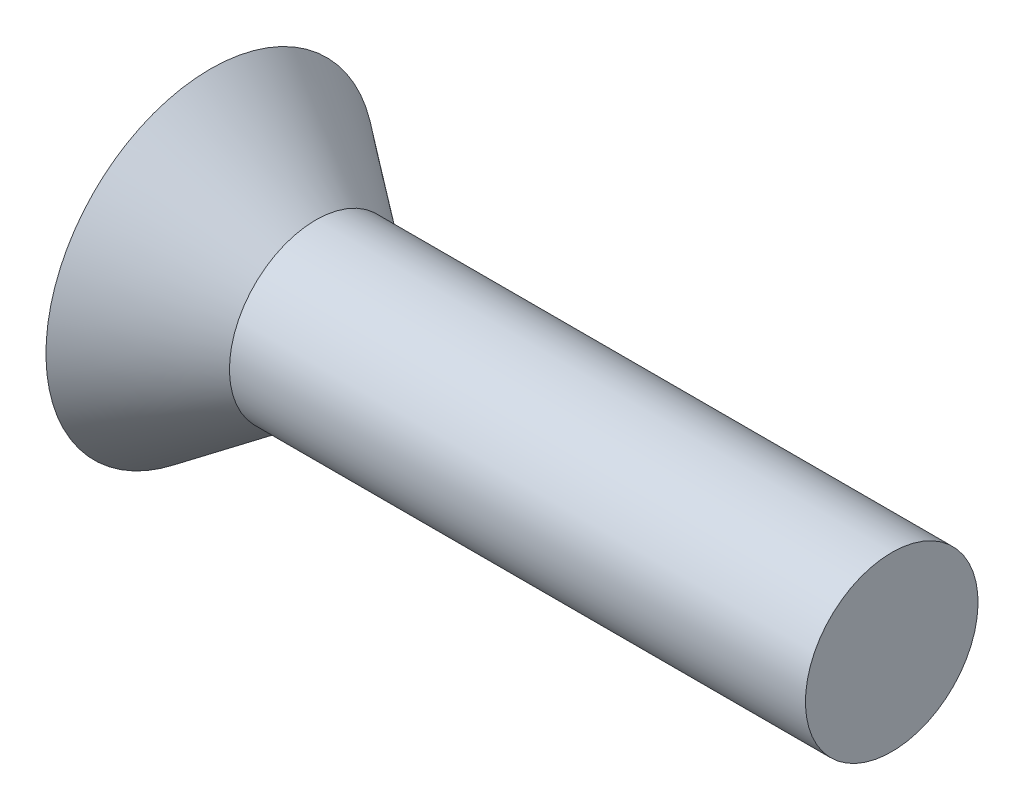
ISO-10303-21;
HEADER;
FILE_DESCRIPTION(('STEP AP214'),'2;1');
FILE_NAME('part.step','',(''),(''),'','','');
FILE_SCHEMA(('AUTOMOTIVE_DESIGN { 1 0 10303 214 1 1 1 1 }'));
ENDSEC;
DATA;
#1=APPLICATION_CONTEXT('core data for automotive mechanical design processes');
#2=APPLICATION_PROTOCOL_DEFINITION('international standard','automotive_design',2000,#1);
#3=PRODUCT_CONTEXT('',#1,'mechanical');
#4=PRODUCT('Part','Part','',(#3));
#5=PRODUCT_RELATED_PRODUCT_CATEGORY('part','',(#4));
#6=PRODUCT_DEFINITION_FORMATION('','',#4);
#7=PRODUCT_DEFINITION_CONTEXT('part definition',#1,'design');
#8=PRODUCT_DEFINITION('design','',#6,#7);
#9=PRODUCT_DEFINITION_SHAPE('','',#8);
#10=(LENGTH_UNIT() NAMED_UNIT(*) SI_UNIT(.MILLI.,.METRE.));
#11=(NAMED_UNIT(*) PLANE_ANGLE_UNIT() SI_UNIT($,.RADIAN.));
#12=(NAMED_UNIT(*) SI_UNIT($,.STERADIAN.) SOLID_ANGLE_UNIT());
#13=UNCERTAINTY_MEASURE_WITH_UNIT(LENGTH_MEASURE(1.E-05),#10,'distance_accuracy_value','');
#14=(GEOMETRIC_REPRESENTATION_CONTEXT(3) GLOBAL_UNCERTAINTY_ASSIGNED_CONTEXT((#13)) GLOBAL_UNIT_ASSIGNED_CONTEXT((#10,
#11,#12)) REPRESENTATION_CONTEXT('',''));
#15=CARTESIAN_POINT('',(0.,0.,0.));
#16=DIRECTION('',(0.,0.,1.));
#17=DIRECTION('',(1.,0.,0.));
#18=AXIS2_PLACEMENT_3D('',#15,#16,#17);
#19=CARTESIAN_POINT('',(-2.9464,2.413,0.));
#20=DIRECTION('',(-1.,0.,0.));
#21=DIRECTION('',(0.,-1.,0.));
#22=AXIS2_PLACEMENT_3D('',#19,#20,#21);
#23=CONICAL_SURFACE('',#22,4.5974,0.63796099926951);
#24=CARTESIAN_POINT('',(0.,2.413,0.));
#25=DIRECTION('',(1.,0.,0.));
#26=DIRECTION('',(0.,1.,0.));
#27=AXIS2_PLACEMENT_3D('',#24,#25,#26);
#28=CIRCLE('',#27,2.413);
#29=CARTESIAN_POINT('',(0.,4.82599999999999,0.));
#30=VERTEX_POINT('',#29);
#31=EDGE_CURVE('E10',#30,#30,#28,.T.);
#32=ORIENTED_EDGE('',*,*,#31,.F.);
#33=EDGE_LOOP('',(#32));
#34=FACE_BOUND('',#33,.T.);
#35=CARTESIAN_POINT('',(-2.9464,2.413,0.));
#36=DIRECTION('',(1.,0.,0.));
#37=DIRECTION('',(0.,1.,0.));
#38=AXIS2_PLACEMENT_3D('',#35,#36,#37);
#39=CIRCLE('',#38,4.5974);
#40=CARTESIAN_POINT('',(-2.9464,7.0104,0.));
#41=VERTEX_POINT('',#40);
#42=EDGE_CURVE('E44',#41,#41,#39,.T.);
#43=ORIENTED_EDGE('',*,*,#42,.T.);
#44=EDGE_LOOP('',(#43));
#45=FACE_BOUND('',#44,.T.);
#46=ADVANCED_FACE('F34',(#34,#45),#23,.T.);
#47=CARTESIAN_POINT('',(22.16486216625,2.413,0.));
#48=DIRECTION('',(1.,0.,0.));
#49=DIRECTION('',(0.,1.,0.));
#50=AXIS2_PLACEMENT_3D('',#47,#48,#49);
#51=CYLINDRICAL_SURFACE('',#50,2.413);
#52=CARTESIAN_POINT('',(16.1036,2.413,0.));
#53=DIRECTION('',(1.,0.,0.));
#54=DIRECTION('',(0.,1.,0.));
#55=AXIS2_PLACEMENT_3D('',#52,#53,#54);
#56=CIRCLE('',#55,2.413);
#57=CARTESIAN_POINT('',(16.1036,4.826,0.));
#58=VERTEX_POINT('',#57);
#59=EDGE_CURVE('E40',#58,#58,#56,.T.);
#60=ORIENTED_EDGE('',*,*,#59,.F.);
#61=EDGE_LOOP('',(#60));
#62=FACE_BOUND('',#61,.T.);
#63=ORIENTED_EDGE('',*,*,#31,.T.);
#64=EDGE_LOOP('',(#63));
#65=FACE_BOUND('',#64,.T.);
#66=ADVANCED_FACE('F59',(#62,#65),#51,.T.);
#67=CARTESIAN_POINT('',(16.1036,0.,0.));
#68=DIRECTION('',(-1.,0.,0.));
#69=DIRECTION('',(0.,-1.,0.));
#70=AXIS2_PLACEMENT_3D('',#67,#68,#69);
#71=PLANE('',#70);
#72=ORIENTED_EDGE('',*,*,#59,.T.);
#73=EDGE_LOOP('',(#72));
#74=FACE_BOUND('',#73,.T.);
#75=ADVANCED_FACE('F54',(#74),#71,.F.);
#76=CARTESIAN_POINT('',(-2.9464,-2.1844,0.));
#77=DIRECTION('',(1.,0.,0.));
#78=DIRECTION('',(0.,1.,0.));
#79=AXIS2_PLACEMENT_3D('',#76,#77,#78);
#80=PLANE('',#79);
#81=ORIENTED_EDGE('',*,*,#42,.F.);
#82=EDGE_LOOP('',(#81));
#83=FACE_BOUND('',#82,.T.);
#84=ADVANCED_FACE('F52',(#83),#80,.F.);
#85=CLOSED_SHELL('',(#46,#66,#75,#84));
#86=MANIFOLD_SOLID_BREP('B2',#85);
#87=ADVANCED_BREP_SHAPE_REPRESENTATION('',(#18,#86),#14);
#88=SHAPE_DEFINITION_REPRESENTATION(#9,#87);
ENDSEC;
END-ISO-10303-21;
